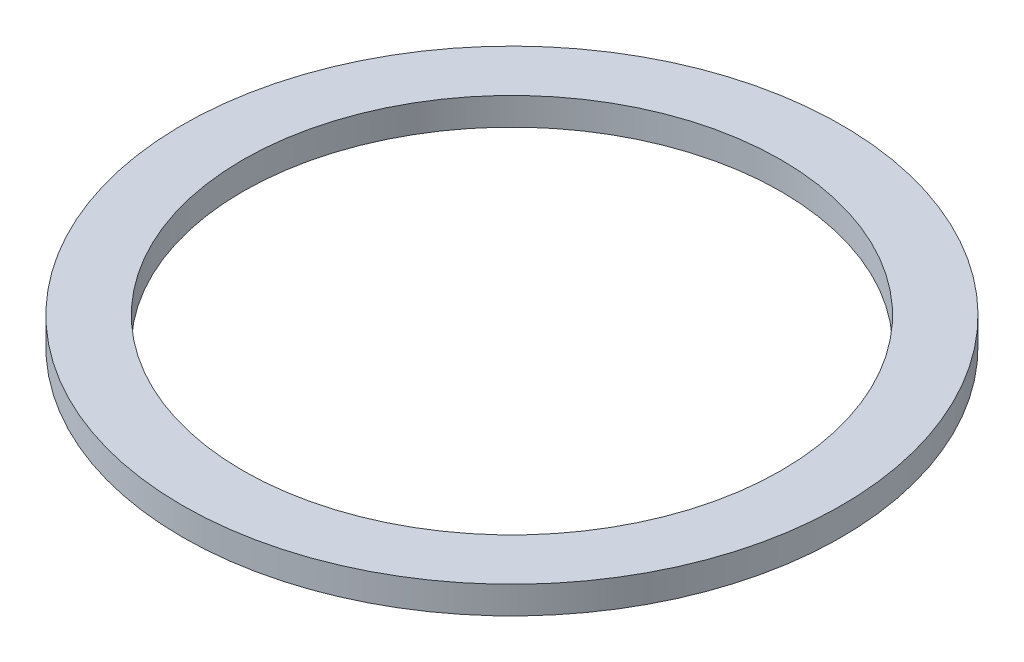
ISO-10303-21;
HEADER;
FILE_DESCRIPTION(('STEP AP214'),'2;1');
FILE_NAME('part.step','',(''),(''),'','','');
FILE_SCHEMA(('AUTOMOTIVE_DESIGN { 1 0 10303 214 1 1 1 1 }'));
ENDSEC;
DATA;
#1=APPLICATION_CONTEXT('core data for automotive mechanical design processes');
#2=APPLICATION_PROTOCOL_DEFINITION('international standard','automotive_design',2000,#1);
#3=PRODUCT_CONTEXT('',#1,'mechanical');
#4=PRODUCT('Part','Part','',(#3));
#5=PRODUCT_RELATED_PRODUCT_CATEGORY('part','',(#4));
#6=PRODUCT_DEFINITION_FORMATION('','',#4);
#7=PRODUCT_DEFINITION_CONTEXT('part definition',#1,'design');
#8=PRODUCT_DEFINITION('design','',#6,#7);
#9=PRODUCT_DEFINITION_SHAPE('','',#8);
#10=(LENGTH_UNIT() NAMED_UNIT(*) SI_UNIT(.MILLI.,.METRE.));
#11=(NAMED_UNIT(*) PLANE_ANGLE_UNIT() SI_UNIT($,.RADIAN.));
#12=(NAMED_UNIT(*) SI_UNIT($,.STERADIAN.) SOLID_ANGLE_UNIT());
#13=UNCERTAINTY_MEASURE_WITH_UNIT(LENGTH_MEASURE(1.E-05),#10,'distance_accuracy_value','');
#14=(GEOMETRIC_REPRESENTATION_CONTEXT(3) GLOBAL_UNCERTAINTY_ASSIGNED_CONTEXT((#13)) GLOBAL_UNIT_ASSIGNED_CONTEXT((#10,
#11,#12)) REPRESENTATION_CONTEXT('',''));
#15=CARTESIAN_POINT('',(0.,0.,0.));
#16=DIRECTION('',(0.,0.,1.));
#17=DIRECTION('',(1.,0.,0.));
#18=AXIS2_PLACEMENT_3D('',#15,#16,#17);
#19=CARTESIAN_POINT('',(0.,0.,0.));
#20=DIRECTION('',(0.,1.,0.));
#21=DIRECTION('',(0.,0.,1.));
#22=AXIS2_PLACEMENT_3D('',#19,#20,#21);
#23=PLANE('',#22);
#24=CARTESIAN_POINT('',(0.,0.,0.));
#25=DIRECTION('',(0.,1.,0.));
#26=DIRECTION('',(0.,0.,1.));
#27=AXIS2_PLACEMENT_3D('',#24,#25,#26);
#28=CIRCLE('',#27,120.);
#29=CARTESIAN_POINT('',(0.,0.,120.));
#30=VERTEX_POINT('',#29);
#31=EDGE_CURVE('E38',#30,#30,#28,.T.);
#32=ORIENTED_EDGE('',*,*,#31,.F.);
#33=EDGE_LOOP('',(#32));
#34=FACE_BOUND('',#33,.T.);
#35=CARTESIAN_POINT('',(0.,0.,0.));
#36=DIRECTION('',(0.,1.,0.));
#37=DIRECTION('',(0.,0.,1.));
#38=AXIS2_PLACEMENT_3D('',#35,#36,#37);
#39=CIRCLE('',#38,112.828427124746);
#40=CARTESIAN_POINT('',(0.,0.,112.828427124746));
#41=VERTEX_POINT('',#40);
#42=EDGE_CURVE('E34',#41,#41,#39,.T.);
#43=ORIENTED_EDGE('',*,*,#42,.T.);
#44=EDGE_LOOP('',(#43));
#45=FACE_BOUND('',#44,.T.);
#46=ADVANCED_FACE('F30',(#34,#45),#23,.F.);
#47=CARTESIAN_POINT('',(0.,0.,0.));
#48=DIRECTION('',(0.,1.,0.));
#49=DIRECTION('',(0.,0.,1.));
#50=AXIS2_PLACEMENT_3D('',#47,#48,#49);
#51=CIRCLE('',#50,98.);
#52=CARTESIAN_POINT('',(0.,0.,98.));
#53=VERTEX_POINT('',#52);
#54=EDGE_CURVE('E46',#53,#53,#51,.T.);
#55=ORIENTED_EDGE('',*,*,#54,.T.);
#56=EDGE_LOOP('',(#55));
#57=FACE_BOUND('',#56,.T.);
#58=CARTESIAN_POINT('',(0.,0.,0.));
#59=DIRECTION('',(0.,-1.,0.));
#60=DIRECTION('',(0.,0.,-1.));
#61=AXIS2_PLACEMENT_3D('',#58,#59,#60);
#62=CIRCLE('',#61,107.171572875254);
#63=CARTESIAN_POINT('',(0.,0.,-107.171572875254));
#64=VERTEX_POINT('',#63);
#65=EDGE_CURVE('E48',#64,#64,#62,.T.);
#66=ORIENTED_EDGE('',*,*,#65,.T.);
#67=EDGE_LOOP('',(#66));
#68=FACE_BOUND('',#67,.T.);
#69=ADVANCED_FACE('F66',(#57,#68),#23,.F.);
#70=CARTESIAN_POINT('',(0.,10.,0.));
#71=DIRECTION('',(0.,1.,0.));
#72=DIRECTION('',(0.,0.,1.));
#73=AXIS2_PLACEMENT_3D('',#70,#71,#72);
#74=PLANE('',#73);
#75=CARTESIAN_POINT('',(0.,10.,0.));
#76=DIRECTION('',(0.,1.,0.));
#77=DIRECTION('',(0.,0.,1.));
#78=AXIS2_PLACEMENT_3D('',#75,#76,#77);
#79=CIRCLE('',#78,120.);
#80=CARTESIAN_POINT('',(0.,10.,120.));
#81=VERTEX_POINT('',#80);
#82=EDGE_CURVE('E10',#81,#81,#79,.T.);
#83=ORIENTED_EDGE('',*,*,#82,.T.);
#84=EDGE_LOOP('',(#83));
#85=FACE_BOUND('',#84,.T.);
#86=CARTESIAN_POINT('',(0.,10.,0.));
#87=DIRECTION('',(0.,1.,0.));
#88=DIRECTION('',(0.,0.,1.));
#89=AXIS2_PLACEMENT_3D('',#86,#87,#88);
#90=CIRCLE('',#89,98.);
#91=CARTESIAN_POINT('',(0.,10.,98.));
#92=VERTEX_POINT('',#91);
#93=EDGE_CURVE('E43',#92,#92,#90,.T.);
#94=ORIENTED_EDGE('',*,*,#93,.F.);
#95=EDGE_LOOP('',(#94));
#96=FACE_BOUND('',#95,.T.);
#97=ADVANCED_FACE('F64',(#85,#96),#74,.T.);
#98=CARTESIAN_POINT('',(0.,10.,0.));
#99=DIRECTION('',(0.,-1.,0.));
#100=DIRECTION('',(0.,0.,-1.));
#101=AXIS2_PLACEMENT_3D('',#98,#99,#100);
#102=CYLINDRICAL_SURFACE('',#101,120.);
#103=ORIENTED_EDGE('',*,*,#82,.F.);
#104=EDGE_LOOP('',(#103));
#105=FACE_BOUND('',#104,.T.);
#106=ORIENTED_EDGE('',*,*,#31,.T.);
#107=EDGE_LOOP('',(#106));
#108=FACE_BOUND('',#107,.T.);
#109=ADVANCED_FACE('F32',(#105,#108),#102,.T.);
#110=CARTESIAN_POINT('',(0.,10.,0.));
#111=DIRECTION('',(0.,-1.,0.));
#112=DIRECTION('',(0.,0.,-1.));
#113=AXIS2_PLACEMENT_3D('',#110,#111,#112);
#114=CYLINDRICAL_SURFACE('',#113,98.);
#115=ORIENTED_EDGE('',*,*,#93,.T.);
#116=EDGE_LOOP('',(#115));
#117=FACE_BOUND('',#116,.T.);
#118=ORIENTED_EDGE('',*,*,#54,.F.);
#119=EDGE_LOOP('',(#118));
#120=FACE_BOUND('',#119,.T.);
#121=ADVANCED_FACE('F61',(#117,#120),#114,.F.);
#122=CARTESIAN_POINT('',(0.,-1.,0.));
#123=DIRECTION('',(0.,-1.,0.));
#124=DIRECTION('',(0.,0.,-1.));
#125=AXIS2_PLACEMENT_3D('',#122,#123,#124);
#126=TOROIDAL_SURFACE('',#125,110.,3.00000000000001);
#127=ORIENTED_EDGE('',*,*,#65,.F.);
#128=EDGE_LOOP('',(#127));
#129=FACE_BOUND('',#128,.T.);
#130=ORIENTED_EDGE('',*,*,#42,.F.);
#131=EDGE_LOOP('',(#130));
#132=FACE_BOUND('',#131,.T.);
#133=ADVANCED_FACE('F91',(#129,#132),#126,.F.);
#134=CLOSED_SHELL('',(#46,#69,#97,#109,#121,#133));
#135=MANIFOLD_SOLID_BREP('B2',#134);
#136=ADVANCED_BREP_SHAPE_REPRESENTATION('',(#18,#135),#14);
#137=SHAPE_DEFINITION_REPRESENTATION(#9,#136);
ENDSEC;
END-ISO-10303-21;
